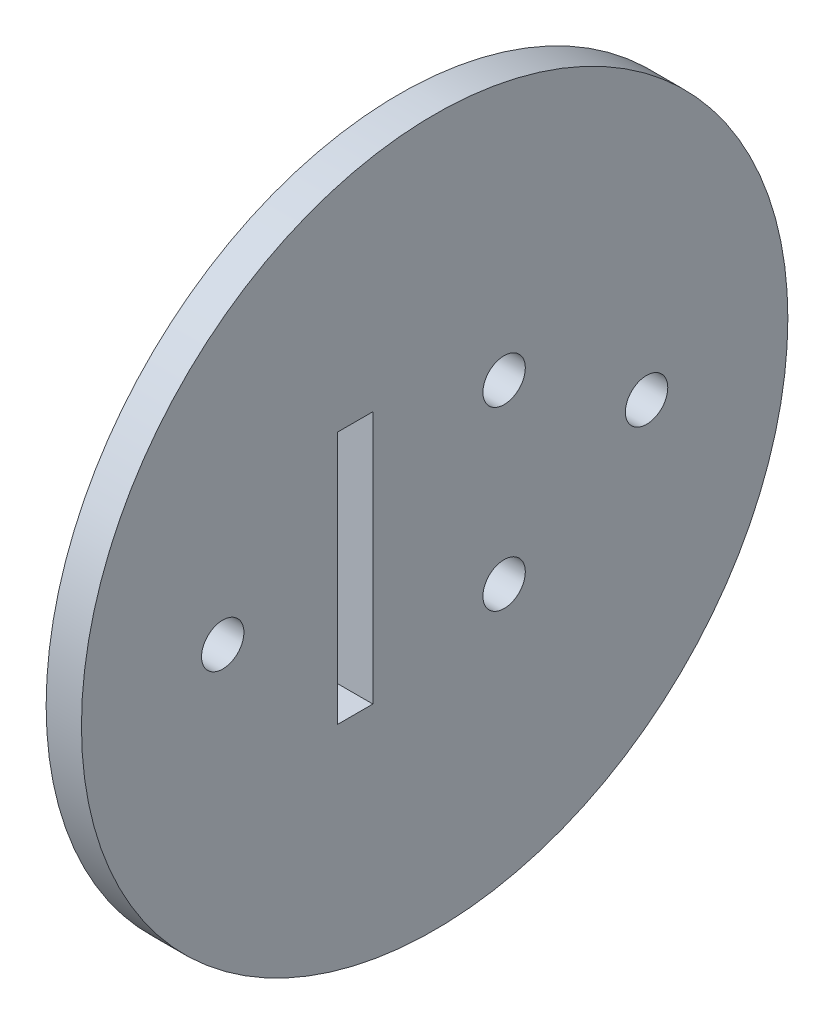
ISO-10303-21;
HEADER;
FILE_DESCRIPTION(('STEP AP214'),'2;1');
FILE_NAME('part.step','',(''),(''),'','','');
FILE_SCHEMA(('AUTOMOTIVE_DESIGN { 1 0 10303 214 1 1 1 1 }'));
ENDSEC;
DATA;
#1=APPLICATION_CONTEXT('core data for automotive mechanical design processes');
#2=APPLICATION_PROTOCOL_DEFINITION('international standard','automotive_design',2000,#1);
#3=PRODUCT_CONTEXT('',#1,'mechanical');
#4=PRODUCT('Part','Part','',(#3));
#5=PRODUCT_RELATED_PRODUCT_CATEGORY('part','',(#4));
#6=PRODUCT_DEFINITION_FORMATION('','',#4);
#7=PRODUCT_DEFINITION_CONTEXT('part definition',#1,'design');
#8=PRODUCT_DEFINITION('design','',#6,#7);
#9=PRODUCT_DEFINITION_SHAPE('','',#8);
#10=(LENGTH_UNIT() NAMED_UNIT(*) SI_UNIT(.MILLI.,.METRE.));
#11=(NAMED_UNIT(*) PLANE_ANGLE_UNIT() SI_UNIT($,.RADIAN.));
#12=(NAMED_UNIT(*) SI_UNIT($,.STERADIAN.) SOLID_ANGLE_UNIT());
#13=UNCERTAINTY_MEASURE_WITH_UNIT(LENGTH_MEASURE(1.E-05),#10,'distance_accuracy_value','');
#14=(GEOMETRIC_REPRESENTATION_CONTEXT(3) GLOBAL_UNCERTAINTY_ASSIGNED_CONTEXT((#13)) GLOBAL_UNIT_ASSIGNED_CONTEXT((#10,
#11,#12)) REPRESENTATION_CONTEXT('',''));
#15=CARTESIAN_POINT('',(0.,0.,0.));
#16=DIRECTION('',(0.,0.,1.));
#17=DIRECTION('',(1.,0.,0.));
#18=AXIS2_PLACEMENT_3D('',#15,#16,#17);
#19=CARTESIAN_POINT('',(3.,0.,0.));
#20=DIRECTION('',(-1.,0.,0.));
#21=DIRECTION('',(0.,0.,1.));
#22=AXIS2_PLACEMENT_3D('',#19,#20,#21);
#23=CYLINDRICAL_SURFACE('',#22,30.);
#24=CARTESIAN_POINT('',(3.,0.,0.));
#25=DIRECTION('',(1.,0.,0.));
#26=DIRECTION('',(0.,0.,-1.));
#27=AXIS2_PLACEMENT_3D('',#24,#25,#26);
#28=CIRCLE('',#27,30.);
#29=CARTESIAN_POINT('',(3.,0.,-30.));
#30=VERTEX_POINT('',#29);
#31=EDGE_CURVE('E11',#30,#30,#28,.T.);
#32=ORIENTED_EDGE('',*,*,#31,.F.);
#33=EDGE_LOOP('',(#32));
#34=FACE_BOUND('',#33,.T.);
#35=CARTESIAN_POINT('',(0.,0.,0.));
#36=DIRECTION('',(1.,0.,0.));
#37=DIRECTION('',(0.,0.,-1.));
#38=AXIS2_PLACEMENT_3D('',#35,#36,#37);
#39=CIRCLE('',#38,30.);
#40=CARTESIAN_POINT('',(0.,0.,-30.));
#41=VERTEX_POINT('',#40);
#42=EDGE_CURVE('E42',#41,#41,#39,.T.);
#43=ORIENTED_EDGE('',*,*,#42,.T.);
#44=EDGE_LOOP('',(#43));
#45=FACE_BOUND('',#44,.T.);
#46=ADVANCED_FACE('F39',(#34,#45),#23,.T.);
#47=CARTESIAN_POINT('',(3.,0.,0.));
#48=DIRECTION('',(1.,0.,0.));
#49=DIRECTION('',(0.,0.,-1.));
#50=AXIS2_PLACEMENT_3D('',#47,#48,#49);
#51=PLANE('',#50);
#52=CARTESIAN_POINT('',(3.,0.,-18.));
#53=DIRECTION('',(1.,0.,0.));
#54=DIRECTION('',(0.,0.,-1.));
#55=AXIS2_PLACEMENT_3D('',#52,#53,#54);
#56=CIRCLE('',#55,1.8);
#57=CARTESIAN_POINT('',(3.,0.,-19.8));
#58=VERTEX_POINT('',#57);
#59=EDGE_CURVE('E166',#58,#58,#56,.T.);
#60=ORIENTED_EDGE('',*,*,#59,.F.);
#61=EDGE_LOOP('',(#60));
#62=FACE_BOUND('',#61,.T.);
#63=CARTESIAN_POINT('',(3.,0.,18.));
#64=DIRECTION('',(1.,0.,0.));
#65=DIRECTION('',(0.,0.,1.));
#66=AXIS2_PLACEMENT_3D('',#63,#64,#65);
#67=CIRCLE('',#66,1.8);
#68=CARTESIAN_POINT('',(3.,0.,19.8));
#69=VERTEX_POINT('',#68);
#70=EDGE_CURVE('E108',#69,#69,#67,.T.);
#71=ORIENTED_EDGE('',*,*,#70,.F.);
#72=EDGE_LOOP('',(#71));
#73=FACE_BOUND('',#72,.T.);
#74=DIRECTION('',(0.,-1.,0.));
#75=VECTOR('',#74,1.);
#76=CARTESIAN_POINT('',(3.,10.75,8.25));
#77=LINE('',#76,#75);
#78=CARTESIAN_POINT('',(3.,10.75,8.25));
#79=VERTEX_POINT('',#78);
#80=CARTESIAN_POINT('',(3.,-10.75,8.25));
#81=VERTEX_POINT('',#80);
#82=EDGE_CURVE('E54',#79,#81,#77,.T.);
#83=ORIENTED_EDGE('',*,*,#82,.F.);
#84=DIRECTION('',(0.,0.,1.));
#85=VECTOR('',#84,1.);
#86=CARTESIAN_POINT('',(3.,10.75,8.25));
#87=LINE('',#86,#85);
#88=CARTESIAN_POINT('',(3.,10.75,5.25));
#89=VERTEX_POINT('',#88);
#90=EDGE_CURVE('E101',#89,#79,#87,.T.);
#91=ORIENTED_EDGE('',*,*,#90,.F.);
#92=DIRECTION('',(0.,1.,0.));
#93=VECTOR('',#92,1.);
#94=CARTESIAN_POINT('',(3.,10.75,5.25));
#95=LINE('',#94,#93);
#96=CARTESIAN_POINT('',(3.,-10.75,5.25));
#97=VERTEX_POINT('',#96);
#98=EDGE_CURVE('E105',#97,#89,#95,.T.);
#99=ORIENTED_EDGE('',*,*,#98,.F.);
#100=DIRECTION('',(0.,0.,-1.));
#101=VECTOR('',#100,1.);
#102=CARTESIAN_POINT('',(3.,-10.75,8.25));
#103=LINE('',#102,#101);
#104=EDGE_CURVE('E117',#81,#97,#103,.T.);
#105=ORIENTED_EDGE('',*,*,#104,.F.);
#106=EDGE_LOOP('',(#83,#91,#99,#105));
#107=FACE_BOUND('',#106,.T.);
#108=CARTESIAN_POINT('',(3.,7.5,-5.9));
#109=DIRECTION('',(1.,0.,0.));
#110=DIRECTION('',(0.,0.,-1.));
#111=AXIS2_PLACEMENT_3D('',#108,#109,#110);
#112=CIRCLE('',#111,1.8);
#113=CARTESIAN_POINT('',(3.,7.5,-7.7));
#114=VERTEX_POINT('',#113);
#115=EDGE_CURVE('E135',#114,#114,#112,.T.);
#116=ORIENTED_EDGE('',*,*,#115,.F.);
#117=EDGE_LOOP('',(#116));
#118=FACE_BOUND('',#117,.T.);
#119=CARTESIAN_POINT('',(3.,-7.5,-5.9));
#120=DIRECTION('',(1.,0.,0.));
#121=DIRECTION('',(0.,0.,-1.));
#122=AXIS2_PLACEMENT_3D('',#119,#120,#121);
#123=CIRCLE('',#122,1.8);
#124=CARTESIAN_POINT('',(3.,-7.5,-7.7));
#125=VERTEX_POINT('',#124);
#126=EDGE_CURVE('E143',#125,#125,#123,.T.);
#127=ORIENTED_EDGE('',*,*,#126,.F.);
#128=EDGE_LOOP('',(#127));
#129=FACE_BOUND('',#128,.T.);
#130=ORIENTED_EDGE('',*,*,#31,.T.);
#131=EDGE_LOOP('',(#130));
#132=FACE_BOUND('',#131,.T.);
#133=ADVANCED_FACE('F150',(#62,#73,#107,#118,#129,#132),#51,.T.);
#134=CARTESIAN_POINT('',(0.,0.,0.));
#135=DIRECTION('',(1.,0.,0.));
#136=DIRECTION('',(0.,0.,-1.));
#137=AXIS2_PLACEMENT_3D('',#134,#135,#136);
#138=PLANE('',#137);
#139=CARTESIAN_POINT('',(0.,0.,-18.));
#140=DIRECTION('',(1.,0.,0.));
#141=DIRECTION('',(0.,0.,-1.));
#142=AXIS2_PLACEMENT_3D('',#139,#140,#141);
#143=CIRCLE('',#142,1.8);
#144=CARTESIAN_POINT('',(0.,0.,-19.8));
#145=VERTEX_POINT('',#144);
#146=EDGE_CURVE('E163',#145,#145,#143,.T.);
#147=ORIENTED_EDGE('',*,*,#146,.T.);
#148=EDGE_LOOP('',(#147));
#149=FACE_BOUND('',#148,.T.);
#150=CARTESIAN_POINT('',(0.,0.,18.));
#151=DIRECTION('',(1.,0.,0.));
#152=DIRECTION('',(0.,0.,1.));
#153=AXIS2_PLACEMENT_3D('',#150,#151,#152);
#154=CIRCLE('',#153,1.8);
#155=CARTESIAN_POINT('',(0.,0.,19.8));
#156=VERTEX_POINT('',#155);
#157=EDGE_CURVE('E172',#156,#156,#154,.T.);
#158=ORIENTED_EDGE('',*,*,#157,.T.);
#159=EDGE_LOOP('',(#158));
#160=FACE_BOUND('',#159,.T.);
#161=DIRECTION('',(0.,0.,1.));
#162=VECTOR('',#161,1.);
#163=CARTESIAN_POINT('',(0.,10.75,8.25));
#164=LINE('',#163,#162);
#165=CARTESIAN_POINT('',(0.,10.75,5.25));
#166=VERTEX_POINT('',#165);
#167=CARTESIAN_POINT('',(0.,10.75,8.25));
#168=VERTEX_POINT('',#167);
#169=EDGE_CURVE('E89',#166,#168,#164,.T.);
#170=ORIENTED_EDGE('',*,*,#169,.T.);
#171=DIRECTION('',(0.,-1.,0.));
#172=VECTOR('',#171,1.);
#173=CARTESIAN_POINT('',(0.,10.75,8.25));
#174=LINE('',#173,#172);
#175=CARTESIAN_POINT('',(0.,-10.75,8.25));
#176=VERTEX_POINT('',#175);
#177=EDGE_CURVE('E82',#168,#176,#174,.T.);
#178=ORIENTED_EDGE('',*,*,#177,.T.);
#179=DIRECTION('',(0.,0.,-1.));
#180=VECTOR('',#179,1.);
#181=CARTESIAN_POINT('',(0.,-10.75,8.25));
#182=LINE('',#181,#180);
#183=CARTESIAN_POINT('',(0.,-10.75,5.25));
#184=VERTEX_POINT('',#183);
#185=EDGE_CURVE('E92',#176,#184,#182,.T.);
#186=ORIENTED_EDGE('',*,*,#185,.T.);
#187=DIRECTION('',(0.,1.,0.));
#188=VECTOR('',#187,1.);
#189=CARTESIAN_POINT('',(0.,10.75,5.25));
#190=LINE('',#189,#188);
#191=EDGE_CURVE('E62',#184,#166,#190,.T.);
#192=ORIENTED_EDGE('',*,*,#191,.T.);
#193=EDGE_LOOP('',(#170,#178,#186,#192));
#194=FACE_BOUND('',#193,.T.);
#195=CARTESIAN_POINT('',(0.,7.5,-5.9));
#196=DIRECTION('',(1.,0.,0.));
#197=DIRECTION('',(0.,0.,-1.));
#198=AXIS2_PLACEMENT_3D('',#195,#196,#197);
#199=CIRCLE('',#198,1.8);
#200=CARTESIAN_POINT('',(0.,7.5,-7.7));
#201=VERTEX_POINT('',#200);
#202=EDGE_CURVE('E118',#201,#201,#199,.T.);
#203=ORIENTED_EDGE('',*,*,#202,.T.);
#204=EDGE_LOOP('',(#203));
#205=FACE_BOUND('',#204,.T.);
#206=CARTESIAN_POINT('',(0.,-7.5,-5.9));
#207=DIRECTION('',(1.,0.,0.));
#208=DIRECTION('',(0.,0.,-1.));
#209=AXIS2_PLACEMENT_3D('',#206,#207,#208);
#210=CIRCLE('',#209,1.8);
#211=CARTESIAN_POINT('',(0.,-7.5,-7.7));
#212=VERTEX_POINT('',#211);
#213=EDGE_CURVE('E139',#212,#212,#210,.T.);
#214=ORIENTED_EDGE('',*,*,#213,.T.);
#215=EDGE_LOOP('',(#214));
#216=FACE_BOUND('',#215,.T.);
#217=ORIENTED_EDGE('',*,*,#42,.F.);
#218=EDGE_LOOP('',(#217));
#219=FACE_BOUND('',#218,.T.);
#220=ADVANCED_FACE('F97',(#149,#160,#194,#205,#216,#219),#138,.F.);
#221=CARTESIAN_POINT('',(0.,-7.5,-5.9));
#222=DIRECTION('',(1.,0.,0.));
#223=DIRECTION('',(0.,0.,-1.));
#224=AXIS2_PLACEMENT_3D('',#221,#222,#223);
#225=CYLINDRICAL_SURFACE('',#224,1.8);
#226=ORIENTED_EDGE('',*,*,#213,.F.);
#227=EDGE_LOOP('',(#226));
#228=FACE_BOUND('',#227,.T.);
#229=ORIENTED_EDGE('',*,*,#126,.T.);
#230=EDGE_LOOP('',(#229));
#231=FACE_BOUND('',#230,.T.);
#232=ADVANCED_FACE('F148',(#228,#231),#225,.F.);
#233=CARTESIAN_POINT('',(0.,7.5,-5.9));
#234=DIRECTION('',(1.,0.,0.));
#235=DIRECTION('',(0.,0.,-1.));
#236=AXIS2_PLACEMENT_3D('',#233,#234,#235);
#237=CYLINDRICAL_SURFACE('',#236,1.8);
#238=ORIENTED_EDGE('',*,*,#202,.F.);
#239=EDGE_LOOP('',(#238));
#240=FACE_BOUND('',#239,.T.);
#241=ORIENTED_EDGE('',*,*,#115,.T.);
#242=EDGE_LOOP('',(#241));
#243=FACE_BOUND('',#242,.T.);
#244=ADVANCED_FACE('F189',(#240,#243),#237,.F.);
#245=CARTESIAN_POINT('',(0.,10.75,8.25));
#246=DIRECTION('',(0.,0.,1.));
#247=DIRECTION('',(1.,0.,0.));
#248=AXIS2_PLACEMENT_3D('',#245,#246,#247);
#249=PLANE('',#248);
#250=ORIENTED_EDGE('',*,*,#82,.T.);
#251=DIRECTION('',(1.,0.,0.));
#252=VECTOR('',#251,1.);
#253=CARTESIAN_POINT('',(0.,-10.75,8.25));
#254=LINE('',#253,#252);
#255=EDGE_CURVE('E78',#176,#81,#254,.T.);
#256=ORIENTED_EDGE('',*,*,#255,.F.);
#257=ORIENTED_EDGE('',*,*,#177,.F.);
#258=DIRECTION('',(1.,0.,0.));
#259=VECTOR('',#258,1.);
#260=CARTESIAN_POINT('',(0.,10.75,8.25));
#261=LINE('',#260,#259);
#262=EDGE_CURVE('E124',#168,#79,#261,.T.);
#263=ORIENTED_EDGE('',*,*,#262,.T.);
#264=EDGE_LOOP('',(#250,#256,#257,#263));
#265=FACE_BOUND('',#264,.T.);
#266=ADVANCED_FACE('F80',(#265),#249,.F.);
#267=CARTESIAN_POINT('',(0.,10.75,8.25));
#268=DIRECTION('',(0.,1.,0.));
#269=DIRECTION('',(0.,0.,1.));
#270=AXIS2_PLACEMENT_3D('',#267,#268,#269);
#271=PLANE('',#270);
#272=ORIENTED_EDGE('',*,*,#90,.T.);
#273=ORIENTED_EDGE('',*,*,#262,.F.);
#274=ORIENTED_EDGE('',*,*,#169,.F.);
#275=DIRECTION('',(1.,0.,0.));
#276=VECTOR('',#275,1.);
#277=CARTESIAN_POINT('',(0.,10.75,5.25));
#278=LINE('',#277,#276);
#279=EDGE_CURVE('E127',#166,#89,#278,.T.);
#280=ORIENTED_EDGE('',*,*,#279,.T.);
#281=EDGE_LOOP('',(#272,#273,#274,#280));
#282=FACE_BOUND('',#281,.T.);
#283=ADVANCED_FACE('F197',(#282),#271,.F.);
#284=CARTESIAN_POINT('',(0.,10.75,5.25));
#285=DIRECTION('',(0.,0.,-1.));
#286=DIRECTION('',(-1.,0.,0.));
#287=AXIS2_PLACEMENT_3D('',#284,#285,#286);
#288=PLANE('',#287);
#289=ORIENTED_EDGE('',*,*,#98,.T.);
#290=ORIENTED_EDGE('',*,*,#279,.F.);
#291=ORIENTED_EDGE('',*,*,#191,.F.);
#292=DIRECTION('',(1.,0.,0.));
#293=VECTOR('',#292,1.);
#294=CARTESIAN_POINT('',(0.,-10.75,5.25));
#295=LINE('',#294,#293);
#296=EDGE_CURVE('E88',#184,#97,#295,.T.);
#297=ORIENTED_EDGE('',*,*,#296,.T.);
#298=EDGE_LOOP('',(#289,#290,#291,#297));
#299=FACE_BOUND('',#298,.T.);
#300=ADVANCED_FACE('F231',(#299),#288,.F.);
#301=CARTESIAN_POINT('',(0.,-10.75,8.25));
#302=DIRECTION('',(0.,-1.,0.));
#303=DIRECTION('',(0.,0.,-1.));
#304=AXIS2_PLACEMENT_3D('',#301,#302,#303);
#305=PLANE('',#304);
#306=ORIENTED_EDGE('',*,*,#104,.T.);
#307=ORIENTED_EDGE('',*,*,#296,.F.);
#308=ORIENTED_EDGE('',*,*,#185,.F.);
#309=ORIENTED_EDGE('',*,*,#255,.T.);
#310=EDGE_LOOP('',(#306,#307,#308,#309));
#311=FACE_BOUND('',#310,.T.);
#312=ADVANCED_FACE('F93',(#311),#305,.F.);
#313=CARTESIAN_POINT('',(0.,0.,18.));
#314=DIRECTION('',(1.,0.,0.));
#315=DIRECTION('',(0.,0.,-1.));
#316=AXIS2_PLACEMENT_3D('',#313,#314,#315);
#317=CYLINDRICAL_SURFACE('',#316,1.8);
#318=ORIENTED_EDGE('',*,*,#157,.F.);
#319=EDGE_LOOP('',(#318));
#320=FACE_BOUND('',#319,.T.);
#321=ORIENTED_EDGE('',*,*,#70,.T.);
#322=EDGE_LOOP('',(#321));
#323=FACE_BOUND('',#322,.T.);
#324=ADVANCED_FACE('F182',(#320,#323),#317,.F.);
#325=CARTESIAN_POINT('',(0.,0.,-18.));
#326=DIRECTION('',(1.,0.,0.));
#327=DIRECTION('',(0.,0.,-1.));
#328=AXIS2_PLACEMENT_3D('',#325,#326,#327);
#329=CYLINDRICAL_SURFACE('',#328,1.8);
#330=ORIENTED_EDGE('',*,*,#146,.F.);
#331=EDGE_LOOP('',(#330));
#332=FACE_BOUND('',#331,.T.);
#333=ORIENTED_EDGE('',*,*,#59,.T.);
#334=EDGE_LOOP('',(#333));
#335=FACE_BOUND('',#334,.T.);
#336=ADVANCED_FACE('F256',(#332,#335),#329,.F.);
#337=CLOSED_SHELL('',(#46,#133,#220,#232,#244,#266,#283,#300,#312,#324,#336));
#338=MANIFOLD_SOLID_BREP('B2',#337);
#339=ADVANCED_BREP_SHAPE_REPRESENTATION('',(#18,#338),#14);
#340=SHAPE_DEFINITION_REPRESENTATION(#9,#339);
ENDSEC;
END-ISO-10303-21;
